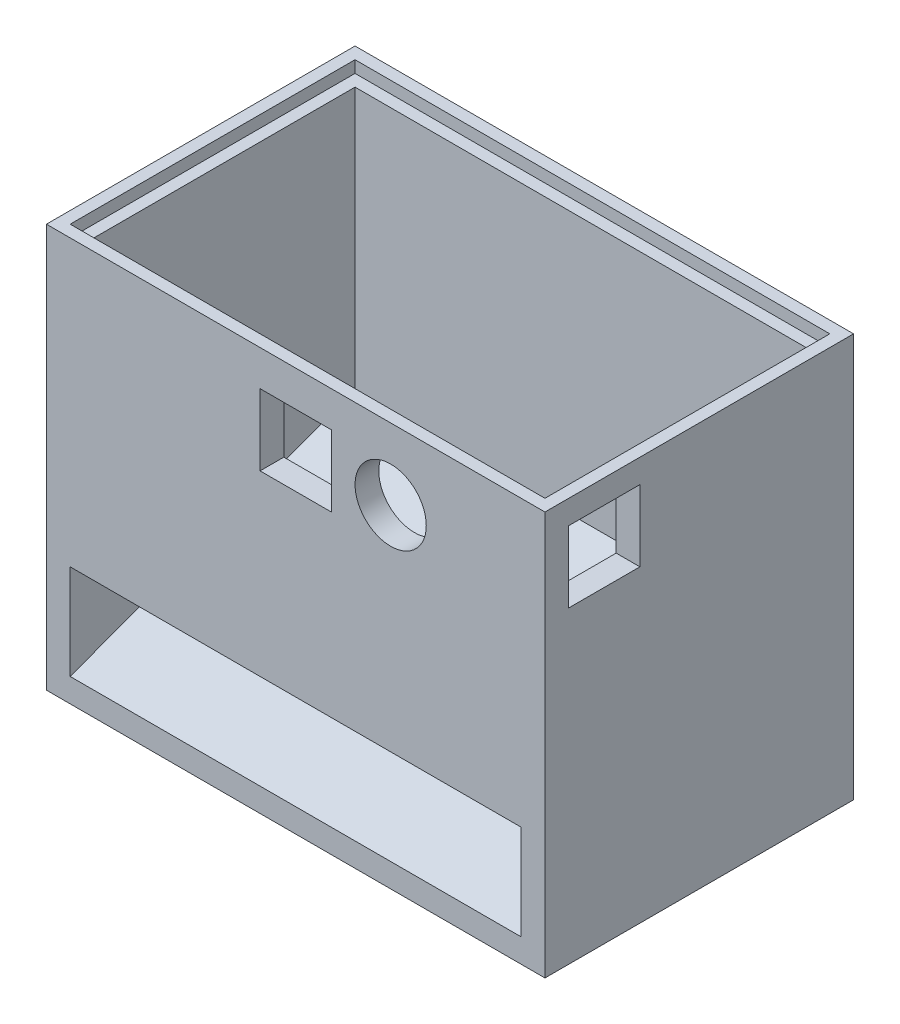
ISO-10303-21;
HEADER;
FILE_DESCRIPTION(('STEP AP214'),'2;1');
FILE_NAME('part.step','',(''),(''),'','','');
FILE_SCHEMA(('AUTOMOTIVE_DESIGN { 1 0 10303 214 1 1 1 1 }'));
ENDSEC;
DATA;
#1=APPLICATION_CONTEXT('core data for automotive mechanical design processes');
#2=APPLICATION_PROTOCOL_DEFINITION('international standard','automotive_design',2000,#1);
#3=PRODUCT_CONTEXT('',#1,'mechanical');
#4=PRODUCT('Part','Part','',(#3));
#5=PRODUCT_RELATED_PRODUCT_CATEGORY('part','',(#4));
#6=PRODUCT_DEFINITION_FORMATION('','',#4);
#7=PRODUCT_DEFINITION_CONTEXT('part definition',#1,'design');
#8=PRODUCT_DEFINITION('design','',#6,#7);
#9=PRODUCT_DEFINITION_SHAPE('','',#8);
#10=(LENGTH_UNIT() NAMED_UNIT(*) SI_UNIT(.MILLI.,.METRE.));
#11=(NAMED_UNIT(*) PLANE_ANGLE_UNIT() SI_UNIT($,.RADIAN.));
#12=(NAMED_UNIT(*) SI_UNIT($,.STERADIAN.) SOLID_ANGLE_UNIT());
#13=UNCERTAINTY_MEASURE_WITH_UNIT(LENGTH_MEASURE(1.E-05),#10,'distance_accuracy_value','');
#14=(GEOMETRIC_REPRESENTATION_CONTEXT(3) GLOBAL_UNCERTAINTY_ASSIGNED_CONTEXT((#13)) GLOBAL_UNIT_ASSIGNED_CONTEXT((#10,
#11,#12)) REPRESENTATION_CONTEXT('',''));
#15=CARTESIAN_POINT('',(0.,0.,0.));
#16=DIRECTION('',(0.,0.,1.));
#17=DIRECTION('',(1.,0.,0.));
#18=AXIS2_PLACEMENT_3D('',#15,#16,#17);
#19=CARTESIAN_POINT('',(-47.5,25.,32.5));
#20=DIRECTION('',(-1.,0.,0.));
#21=DIRECTION('',(0.,0.,1.));
#22=AXIS2_PLACEMENT_3D('',#19,#20,#21);
#23=PLANE('',#22);
#24=DIRECTION('',(0.,-0.347934022521281,0.937519021658847));
#25=VECTOR('',#24,1.);
#26=CARTESIAN_POINT('',(-47.5,5.,32.5));
#27=LINE('',#26,#25);
#28=CARTESIAN_POINT('',(-47.5,27.2673256424587,-27.5));
#29=VERTEX_POINT('',#28);
#30=CARTESIAN_POINT('',(-47.5,5.,32.5));
#31=VERTEX_POINT('',#30);
#32=EDGE_CURVE('E58',#29,#31,#27,.T.);
#33=ORIENTED_EDGE('',*,*,#32,.F.);
#34=DIRECTION('',(0.,-1.,0.));
#35=VECTOR('',#34,1.);
#36=CARTESIAN_POINT('',(-47.5,25.,-27.5));
#37=LINE('',#36,#35);
#38=CARTESIAN_POINT('',(-47.5,82.5,-27.5));
#39=VERTEX_POINT('',#38);
#40=EDGE_CURVE('E273',#39,#29,#37,.T.);
#41=ORIENTED_EDGE('',*,*,#40,.F.);
#42=DIRECTION('',(0.,0.,-1.));
#43=VECTOR('',#42,1.);
#44=CARTESIAN_POINT('',(-47.5,82.5,32.5));
#45=LINE('',#44,#43);
#46=CARTESIAN_POINT('',(-47.5,82.5,27.5));
#47=VERTEX_POINT('',#46);
#48=EDGE_CURVE('E290',#47,#39,#45,.T.);
#49=ORIENTED_EDGE('',*,*,#48,.F.);
#50=DIRECTION('',(0.,-1.,0.));
#51=VECTOR('',#50,1.);
#52=CARTESIAN_POINT('',(-47.5,85.,27.5));
#53=LINE('',#52,#51);
#54=CARTESIAN_POINT('',(-47.5,25.,27.5));
#55=VERTEX_POINT('',#54);
#56=EDGE_CURVE('E270',#47,#55,#53,.T.);
#57=ORIENTED_EDGE('',*,*,#56,.T.);
#58=DIRECTION('',(0.,0.,-1.));
#59=VECTOR('',#58,1.);
#60=CARTESIAN_POINT('',(-47.5,25.,32.5));
#61=LINE('',#60,#59);
#62=CARTESIAN_POINT('',(-47.5,25.,32.5));
#63=VERTEX_POINT('',#62);
#64=EDGE_CURVE('E261',#63,#55,#61,.T.);
#65=ORIENTED_EDGE('',*,*,#64,.F.);
#66=DIRECTION('',(0.,-1.,0.));
#67=VECTOR('',#66,1.);
#68=CARTESIAN_POINT('',(-47.5,25.,32.5));
#69=LINE('',#68,#67);
#70=EDGE_CURVE('E226',#63,#31,#69,.T.);
#71=ORIENTED_EDGE('',*,*,#70,.T.);
#72=EDGE_LOOP('',(#33,#41,#49,#57,#65,#71));
#73=FACE_BOUND('',#72,.T.);
#74=ADVANCED_FACE('F43',(#73),#23,.F.);
#75=CARTESIAN_POINT('',(-47.5,25.,-27.5));
#76=DIRECTION('',(0.,0.,-1.));
#77=DIRECTION('',(-1.,0.,0.));
#78=AXIS2_PLACEMENT_3D('',#75,#76,#77);
#79=PLANE('',#78);
#80=DIRECTION('',(-1.,0.,0.));
#81=VECTOR('',#80,1.);
#82=CARTESIAN_POINT('',(47.5,27.2673256424587,-27.5));
#83=LINE('',#82,#81);
#84=CARTESIAN_POINT('',(47.5,27.2673256424587,-27.5));
#85=VERTEX_POINT('',#84);
#86=EDGE_CURVE('E65',#85,#29,#83,.T.);
#87=ORIENTED_EDGE('',*,*,#86,.F.);
#88=DIRECTION('',(0.,-1.,0.));
#89=VECTOR('',#88,1.);
#90=CARTESIAN_POINT('',(47.5,25.,-27.5));
#91=LINE('',#90,#89);
#92=CARTESIAN_POINT('',(47.5,82.5,-27.5));
#93=VERTEX_POINT('',#92);
#94=EDGE_CURVE('E206',#93,#85,#91,.T.);
#95=ORIENTED_EDGE('',*,*,#94,.F.);
#96=DIRECTION('',(1.,0.,0.));
#97=VECTOR('',#96,1.);
#98=CARTESIAN_POINT('',(-47.5,82.5,-27.5));
#99=LINE('',#98,#97);
#100=EDGE_CURVE('E433',#39,#93,#99,.T.);
#101=ORIENTED_EDGE('',*,*,#100,.F.);
#102=ORIENTED_EDGE('',*,*,#40,.T.);
#103=EDGE_LOOP('',(#87,#95,#101,#102));
#104=FACE_BOUND('',#103,.T.);
#105=ADVANCED_FACE('F309',(#104),#79,.F.);
#106=CARTESIAN_POINT('',(47.5,25.,-27.5));
#107=DIRECTION('',(1.,0.,0.));
#108=DIRECTION('',(0.,0.,-1.));
#109=AXIS2_PLACEMENT_3D('',#106,#107,#108);
#110=PLANE('',#109);
#111=DIRECTION('',(0.,-0.347934022521281,0.937519021658847));
#112=VECTOR('',#111,1.);
#113=CARTESIAN_POINT('',(47.5,5.,32.5));
#114=LINE('',#113,#112);
#115=CARTESIAN_POINT('',(47.5,5.,32.5));
#116=VERTEX_POINT('',#115);
#117=EDGE_CURVE('E210',#85,#116,#114,.T.);
#118=ORIENTED_EDGE('',*,*,#117,.T.);
#119=DIRECTION('',(0.,-1.,0.));
#120=VECTOR('',#119,1.);
#121=CARTESIAN_POINT('',(47.5,25.,32.5));
#122=LINE('',#121,#120);
#123=CARTESIAN_POINT('',(47.5,25.,32.5));
#124=VERTEX_POINT('',#123);
#125=EDGE_CURVE('E194',#124,#116,#122,.T.);
#126=ORIENTED_EDGE('',*,*,#125,.F.);
#127=DIRECTION('',(0.,0.,1.));
#128=VECTOR('',#127,1.);
#129=CARTESIAN_POINT('',(47.5,25.,-27.5));
#130=LINE('',#129,#128);
#131=CARTESIAN_POINT('',(47.5,25.,27.5));
#132=VERTEX_POINT('',#131);
#133=EDGE_CURVE('E207',#132,#124,#130,.T.);
#134=ORIENTED_EDGE('',*,*,#133,.F.);
#135=DIRECTION('',(0.,-1.,0.));
#136=VECTOR('',#135,1.);
#137=CARTESIAN_POINT('',(47.5,85.,27.5));
#138=LINE('',#137,#136);
#139=CARTESIAN_POINT('',(47.5,65.,27.5));
#140=VERTEX_POINT('',#139);
#141=EDGE_CURVE('E282',#140,#132,#138,.T.);
#142=ORIENTED_EDGE('',*,*,#141,.F.);
#143=DIRECTION('',(0.,0.,-1.));
#144=VECTOR('',#143,1.);
#145=CARTESIAN_POINT('',(47.5,65.,-27.5));
#146=LINE('',#145,#144);
#147=CARTESIAN_POINT('',(47.5,65.,12.5));
#148=VERTEX_POINT('',#147);
#149=EDGE_CURVE('E284',#140,#148,#146,.T.);
#150=ORIENTED_EDGE('',*,*,#149,.T.);
#151=DIRECTION('',(0.,1.,0.));
#152=VECTOR('',#151,1.);
#153=CARTESIAN_POINT('',(47.5,25.,12.5));
#154=LINE('',#153,#152);
#155=CARTESIAN_POINT('',(47.5,80.,12.5));
#156=VERTEX_POINT('',#155);
#157=EDGE_CURVE('E356',#148,#156,#154,.T.);
#158=ORIENTED_EDGE('',*,*,#157,.T.);
#159=DIRECTION('',(0.,0.,1.));
#160=VECTOR('',#159,1.);
#161=CARTESIAN_POINT('',(47.5,80.,-27.5));
#162=LINE('',#161,#160);
#163=CARTESIAN_POINT('',(47.5,80.,27.5));
#164=VERTEX_POINT('',#163);
#165=EDGE_CURVE('E358',#156,#164,#162,.T.);
#166=ORIENTED_EDGE('',*,*,#165,.T.);
#167=CARTESIAN_POINT('',(47.5,82.5,27.5));
#168=VERTEX_POINT('',#167);
#169=EDGE_CURVE('E287',#168,#164,#138,.T.);
#170=ORIENTED_EDGE('',*,*,#169,.F.);
#171=DIRECTION('',(0.,0.,1.));
#172=VECTOR('',#171,1.);
#173=CARTESIAN_POINT('',(47.5,82.5,-27.5));
#174=LINE('',#173,#172);
#175=EDGE_CURVE('E425',#93,#168,#174,.T.);
#176=ORIENTED_EDGE('',*,*,#175,.F.);
#177=ORIENTED_EDGE('',*,*,#94,.T.);
#178=EDGE_LOOP('',(#118,#126,#134,#142,#150,#158,#166,#170,#176,#177));
#179=FACE_BOUND('',#178,.T.);
#180=ADVANCED_FACE('F211',(#179),#110,.F.);
#181=CARTESIAN_POINT('',(-47.5,85.,27.5));
#182=DIRECTION('',(0.,0.,-1.));
#183=DIRECTION('',(-1.,0.,0.));
#184=AXIS2_PLACEMENT_3D('',#181,#182,#183);
#185=PLANE('',#184);
#186=ORIENTED_EDGE('',*,*,#169,.T.);
#187=DIRECTION('',(1.,0.,0.));
#188=VECTOR('',#187,1.);
#189=CARTESIAN_POINT('',(42.5,80.,27.5));
#190=LINE('',#189,#188);
#191=CARTESIAN_POINT('',(52.5,80.,27.5));
#192=VERTEX_POINT('',#191);
#193=EDGE_CURVE('E348',#164,#192,#190,.T.);
#194=ORIENTED_EDGE('',*,*,#193,.T.);
#195=DIRECTION('',(0.,-1.,0.));
#196=VECTOR('',#195,1.);
#197=CARTESIAN_POINT('',(52.5,80.,27.5));
#198=LINE('',#197,#196);
#199=CARTESIAN_POINT('',(52.5,65.,27.5));
#200=VERTEX_POINT('',#199);
#201=EDGE_CURVE('E334',#192,#200,#198,.T.);
#202=ORIENTED_EDGE('',*,*,#201,.T.);
#203=DIRECTION('',(1.,0.,0.));
#204=VECTOR('',#203,1.);
#205=CARTESIAN_POINT('',(42.5,65.,27.5));
#206=LINE('',#205,#204);
#207=EDGE_CURVE('E347',#140,#200,#206,.T.);
#208=ORIENTED_EDGE('',*,*,#207,.F.);
#209=ORIENTED_EDGE('',*,*,#141,.T.);
#210=DIRECTION('',(1.,0.,0.));
#211=VECTOR('',#210,1.);
#212=CARTESIAN_POINT('',(-47.5,25.,27.5));
#213=LINE('',#212,#211);
#214=EDGE_CURVE('E279',#55,#132,#213,.T.);
#215=ORIENTED_EDGE('',*,*,#214,.F.);
#216=ORIENTED_EDGE('',*,*,#56,.F.);
#217=DIRECTION('',(1.,0.,0.));
#218=VECTOR('',#217,1.);
#219=CARTESIAN_POINT('',(-47.5,82.5,27.5));
#220=LINE('',#219,#218);
#221=EDGE_CURVE('E11',#47,#168,#220,.T.);
#222=ORIENTED_EDGE('',*,*,#221,.T.);
#223=EDGE_LOOP('',(#186,#194,#202,#208,#209,#215,#216,#222));
#224=FACE_BOUND('',#223,.T.);
#225=CARTESIAN_POINT('',(20.,70.,27.5));
#226=DIRECTION('',(0.,0.,-1.));
#227=DIRECTION('',(-1.,0.,0.));
#228=AXIS2_PLACEMENT_3D('',#225,#226,#227);
#229=CIRCLE('',#228,7.5);
#230=CARTESIAN_POINT('',(12.5,70.,27.5));
#231=VERTEX_POINT('',#230);
#232=EDGE_CURVE('E377',#231,#231,#229,.T.);
#233=ORIENTED_EDGE('',*,*,#232,.F.);
#234=EDGE_LOOP('',(#233));
#235=FACE_BOUND('',#234,.T.);
#236=DIRECTION('',(-1.,0.,0.));
#237=VECTOR('',#236,1.);
#238=CARTESIAN_POINT('',(-47.5,62.5,27.5));
#239=LINE('',#238,#237);
#240=CARTESIAN_POINT('',(7.50000000000001,62.5,27.5));
#241=VERTEX_POINT('',#240);
#242=CARTESIAN_POINT('',(-7.49999999999999,62.5,27.5));
#243=VERTEX_POINT('',#242);
#244=EDGE_CURVE('E394',#241,#243,#239,.T.);
#245=ORIENTED_EDGE('',*,*,#244,.F.);
#246=DIRECTION('',(0.,1.,0.));
#247=VECTOR('',#246,1.);
#248=CARTESIAN_POINT('',(7.50000000000001,85.,27.5));
#249=LINE('',#248,#247);
#250=CARTESIAN_POINT('',(7.5,77.5,27.5));
#251=VERTEX_POINT('',#250);
#252=EDGE_CURVE('E396',#241,#251,#249,.T.);
#253=ORIENTED_EDGE('',*,*,#252,.T.);
#254=DIRECTION('',(-1.,0.,0.));
#255=VECTOR('',#254,1.);
#256=CARTESIAN_POINT('',(-47.5,77.5,27.5));
#257=LINE('',#256,#255);
#258=CARTESIAN_POINT('',(-7.49999999999999,77.5,27.5));
#259=VERTEX_POINT('',#258);
#260=EDGE_CURVE('E388',#251,#259,#257,.T.);
#261=ORIENTED_EDGE('',*,*,#260,.T.);
#262=DIRECTION('',(0.,1.,0.));
#263=VECTOR('',#262,1.);
#264=CARTESIAN_POINT('',(-7.49999999999999,85.,27.5));
#265=LINE('',#264,#263);
#266=EDGE_CURVE('E391',#243,#259,#265,.T.);
#267=ORIENTED_EDGE('',*,*,#266,.F.);
#268=EDGE_LOOP('',(#245,#253,#261,#267));
#269=FACE_BOUND('',#268,.T.);
#270=ADVANCED_FACE('F319',(#224,#235,#269),#185,.T.);
#271=CARTESIAN_POINT('',(-52.5,5.,32.5));
#272=DIRECTION('',(0.,0.,-1.));
#273=DIRECTION('',(-1.,0.,0.));
#274=AXIS2_PLACEMENT_3D('',#271,#272,#273);
#275=PLANE('',#274);
#276=DIRECTION('',(1.,0.,0.));
#277=VECTOR('',#276,1.);
#278=CARTESIAN_POINT('',(-52.5,0.,32.5));
#279=LINE('',#278,#277);
#280=CARTESIAN_POINT('',(-52.5,0.,32.5));
#281=VERTEX_POINT('',#280);
#282=CARTESIAN_POINT('',(52.5,0.,32.5));
#283=VERTEX_POINT('',#282);
#284=EDGE_CURVE('E217',#281,#283,#279,.T.);
#285=ORIENTED_EDGE('',*,*,#284,.T.);
#286=DIRECTION('',(0.,-1.,0.));
#287=VECTOR('',#286,1.);
#288=CARTESIAN_POINT('',(52.5,5.,32.5));
#289=LINE('',#288,#287);
#290=CARTESIAN_POINT('',(52.5,85.,32.5));
#291=VERTEX_POINT('',#290);
#292=EDGE_CURVE('E216',#291,#283,#289,.T.);
#293=ORIENTED_EDGE('',*,*,#292,.F.);
#294=DIRECTION('',(1.,0.,0.));
#295=VECTOR('',#294,1.);
#296=CARTESIAN_POINT('',(-52.5,85.,32.5));
#297=LINE('',#296,#295);
#298=CARTESIAN_POINT('',(-52.5,85.,32.5));
#299=VERTEX_POINT('',#298);
#300=EDGE_CURVE('E259',#299,#291,#297,.T.);
#301=ORIENTED_EDGE('',*,*,#300,.F.);
#302=DIRECTION('',(0.,-1.,0.));
#303=VECTOR('',#302,1.);
#304=CARTESIAN_POINT('',(-52.5,5.,32.5));
#305=LINE('',#304,#303);
#306=EDGE_CURVE('E220',#299,#281,#305,.T.);
#307=ORIENTED_EDGE('',*,*,#306,.T.);
#308=EDGE_LOOP('',(#285,#293,#301,#307));
#309=FACE_BOUND('',#308,.T.);
#310=ORIENTED_EDGE('',*,*,#70,.F.);
#311=DIRECTION('',(1.,0.,0.));
#312=VECTOR('',#311,1.);
#313=CARTESIAN_POINT('',(-52.5,25.,32.5));
#314=LINE('',#313,#312);
#315=EDGE_CURVE('E202',#63,#124,#314,.T.);
#316=ORIENTED_EDGE('',*,*,#315,.T.);
#317=ORIENTED_EDGE('',*,*,#125,.T.);
#318=DIRECTION('',(1.,0.,0.));
#319=VECTOR('',#318,1.);
#320=CARTESIAN_POINT('',(-52.5,5.,32.5));
#321=LINE('',#320,#319);
#322=EDGE_CURVE('E200',#31,#116,#321,.T.);
#323=ORIENTED_EDGE('',*,*,#322,.F.);
#324=EDGE_LOOP('',(#310,#316,#317,#323));
#325=FACE_BOUND('',#324,.T.);
#326=CARTESIAN_POINT('',(20.,70.,32.5));
#327=DIRECTION('',(0.,0.,1.));
#328=DIRECTION('',(1.,0.,0.));
#329=AXIS2_PLACEMENT_3D('',#326,#327,#328);
#330=CIRCLE('',#329,7.5);
#331=CARTESIAN_POINT('',(27.5,70.,32.5));
#332=VERTEX_POINT('',#331);
#333=EDGE_CURVE('E361',#332,#332,#330,.T.);
#334=ORIENTED_EDGE('',*,*,#333,.F.);
#335=EDGE_LOOP('',(#334));
#336=FACE_BOUND('',#335,.T.);
#337=DIRECTION('',(0.,-1.,0.));
#338=VECTOR('',#337,1.);
#339=CARTESIAN_POINT('',(7.50000000000001,0.,32.5));
#340=LINE('',#339,#338);
#341=CARTESIAN_POINT('',(7.5,77.5,32.5));
#342=VERTEX_POINT('',#341);
#343=CARTESIAN_POINT('',(7.50000000000001,62.5,32.5));
#344=VERTEX_POINT('',#343);
#345=EDGE_CURVE('E362',#342,#344,#340,.T.);
#346=ORIENTED_EDGE('',*,*,#345,.T.);
#347=DIRECTION('',(1.,0.,0.));
#348=VECTOR('',#347,1.);
#349=CARTESIAN_POINT('',(0.,62.5,32.5));
#350=LINE('',#349,#348);
#351=CARTESIAN_POINT('',(-7.49999999999999,62.5,32.5));
#352=VERTEX_POINT('',#351);
#353=EDGE_CURVE('E371',#352,#344,#350,.T.);
#354=ORIENTED_EDGE('',*,*,#353,.F.);
#355=DIRECTION('',(0.,-1.,0.));
#356=VECTOR('',#355,1.);
#357=CARTESIAN_POINT('',(-7.49999999999999,0.,32.5));
#358=LINE('',#357,#356);
#359=CARTESIAN_POINT('',(-7.5,77.5,32.5));
#360=VERTEX_POINT('',#359);
#361=EDGE_CURVE('E368',#360,#352,#358,.T.);
#362=ORIENTED_EDGE('',*,*,#361,.F.);
#363=DIRECTION('',(1.,0.,0.));
#364=VECTOR('',#363,1.);
#365=CARTESIAN_POINT('',(0.,77.5,32.5));
#366=LINE('',#365,#364);
#367=EDGE_CURVE('E365',#360,#342,#366,.T.);
#368=ORIENTED_EDGE('',*,*,#367,.T.);
#369=EDGE_LOOP('',(#346,#354,#362,#368));
#370=FACE_BOUND('',#369,.T.);
#371=ADVANCED_FACE('F197',(#309,#325,#336,#370),#275,.F.);
#372=CARTESIAN_POINT('',(52.5,5.,32.5));
#373=DIRECTION('',(-1.,0.,0.));
#374=DIRECTION('',(0.,0.,1.));
#375=AXIS2_PLACEMENT_3D('',#372,#373,#374);
#376=PLANE('',#375);
#377=DIRECTION('',(0.,0.,-1.));
#378=VECTOR('',#377,1.);
#379=CARTESIAN_POINT('',(52.5,65.,27.5));
#380=LINE('',#379,#378);
#381=CARTESIAN_POINT('',(52.5,65.,12.5));
#382=VERTEX_POINT('',#381);
#383=EDGE_CURVE('E332',#200,#382,#380,.T.);
#384=ORIENTED_EDGE('',*,*,#383,.F.);
#385=ORIENTED_EDGE('',*,*,#201,.F.);
#386=DIRECTION('',(0.,0.,1.));
#387=VECTOR('',#386,1.);
#388=CARTESIAN_POINT('',(52.5,80.,27.5));
#389=LINE('',#388,#387);
#390=CARTESIAN_POINT('',(52.5,80.,12.5));
#391=VERTEX_POINT('',#390);
#392=EDGE_CURVE('E340',#391,#192,#389,.T.);
#393=ORIENTED_EDGE('',*,*,#392,.F.);
#394=DIRECTION('',(0.,1.,0.));
#395=VECTOR('',#394,1.);
#396=CARTESIAN_POINT('',(52.5,80.,12.5));
#397=LINE('',#396,#395);
#398=EDGE_CURVE('E336',#382,#391,#397,.T.);
#399=ORIENTED_EDGE('',*,*,#398,.F.);
#400=EDGE_LOOP('',(#384,#385,#393,#399));
#401=FACE_BOUND('',#400,.T.);
#402=DIRECTION('',(0.,0.,-1.));
#403=VECTOR('',#402,1.);
#404=CARTESIAN_POINT('',(52.5,0.,32.5));
#405=LINE('',#404,#403);
#406=CARTESIAN_POINT('',(52.5,0.,-32.5));
#407=VERTEX_POINT('',#406);
#408=EDGE_CURVE('E228',#283,#407,#405,.T.);
#409=ORIENTED_EDGE('',*,*,#408,.T.);
#410=DIRECTION('',(0.,-1.,0.));
#411=VECTOR('',#410,1.);
#412=CARTESIAN_POINT('',(52.5,5.,-32.5));
#413=LINE('',#412,#411);
#414=CARTESIAN_POINT('',(52.5,85.,-32.5));
#415=VERTEX_POINT('',#414);
#416=EDGE_CURVE('E51',#415,#407,#413,.T.);
#417=ORIENTED_EDGE('',*,*,#416,.F.);
#418=DIRECTION('',(0.,0.,-1.));
#419=VECTOR('',#418,1.);
#420=CARTESIAN_POINT('',(52.5,85.,32.5));
#421=LINE('',#420,#419);
#422=EDGE_CURVE('E269',#291,#415,#421,.T.);
#423=ORIENTED_EDGE('',*,*,#422,.F.);
#424=ORIENTED_EDGE('',*,*,#292,.T.);
#425=EDGE_LOOP('',(#409,#417,#423,#424));
#426=FACE_BOUND('',#425,.T.);
#427=ADVANCED_FACE('F45',(#401,#426),#376,.F.);
#428=CARTESIAN_POINT('',(-52.5,5.,-32.5));
#429=DIRECTION('',(0.,0.,1.));
#430=DIRECTION('',(1.,0.,0.));
#431=AXIS2_PLACEMENT_3D('',#428,#429,#430);
#432=PLANE('',#431);
#433=DIRECTION('',(-1.,0.,0.));
#434=VECTOR('',#433,1.);
#435=CARTESIAN_POINT('',(-52.5,0.,-32.5));
#436=LINE('',#435,#434);
#437=CARTESIAN_POINT('',(-52.5,0.,-32.5));
#438=VERTEX_POINT('',#437);
#439=EDGE_CURVE('E231',#407,#438,#436,.T.);
#440=ORIENTED_EDGE('',*,*,#439,.T.);
#441=DIRECTION('',(0.,-1.,0.));
#442=VECTOR('',#441,1.);
#443=CARTESIAN_POINT('',(-52.5,5.,-32.5));
#444=LINE('',#443,#442);
#445=CARTESIAN_POINT('',(-52.5,85.,-32.5));
#446=VERTEX_POINT('',#445);
#447=EDGE_CURVE('E236',#446,#438,#444,.T.);
#448=ORIENTED_EDGE('',*,*,#447,.F.);
#449=DIRECTION('',(-1.,0.,0.));
#450=VECTOR('',#449,1.);
#451=CARTESIAN_POINT('',(-52.5,85.,-32.5));
#452=LINE('',#451,#450);
#453=EDGE_CURVE('E243',#415,#446,#452,.T.);
#454=ORIENTED_EDGE('',*,*,#453,.F.);
#455=ORIENTED_EDGE('',*,*,#416,.T.);
#456=EDGE_LOOP('',(#440,#448,#454,#455));
#457=FACE_BOUND('',#456,.T.);
#458=ADVANCED_FACE('F241',(#457),#432,.F.);
#459=CARTESIAN_POINT('',(-52.5,5.,32.5));
#460=DIRECTION('',(1.,0.,0.));
#461=DIRECTION('',(0.,0.,-1.));
#462=AXIS2_PLACEMENT_3D('',#459,#460,#461);
#463=PLANE('',#462);
#464=DIRECTION('',(0.,0.,1.));
#465=VECTOR('',#464,1.);
#466=CARTESIAN_POINT('',(-52.5,0.,32.5));
#467=LINE('',#466,#465);
#468=EDGE_CURVE('E222',#438,#281,#467,.T.);
#469=ORIENTED_EDGE('',*,*,#468,.T.);
#470=ORIENTED_EDGE('',*,*,#306,.F.);
#471=DIRECTION('',(0.,0.,1.));
#472=VECTOR('',#471,1.);
#473=CARTESIAN_POINT('',(-52.5,85.,32.5));
#474=LINE('',#473,#472);
#475=EDGE_CURVE('E262',#446,#299,#474,.T.);
#476=ORIENTED_EDGE('',*,*,#475,.F.);
#477=ORIENTED_EDGE('',*,*,#447,.T.);
#478=EDGE_LOOP('',(#469,#470,#476,#477));
#479=FACE_BOUND('',#478,.T.);
#480=ADVANCED_FACE('F253',(#479),#463,.F.);
#481=CARTESIAN_POINT('',(0.,0.,0.));
#482=DIRECTION('',(0.,-1.,0.));
#483=DIRECTION('',(0.,0.,-1.));
#484=AXIS2_PLACEMENT_3D('',#481,#482,#483);
#485=PLANE('',#484);
#486=ORIENTED_EDGE('',*,*,#408,.F.);
#487=ORIENTED_EDGE('',*,*,#284,.F.);
#488=ORIENTED_EDGE('',*,*,#468,.F.);
#489=ORIENTED_EDGE('',*,*,#439,.F.);
#490=EDGE_LOOP('',(#486,#487,#488,#489));
#491=FACE_BOUND('',#490,.T.);
#492=ADVANCED_FACE('F250',(#491),#485,.T.);
#493=CARTESIAN_POINT('',(0.,85.,0.));
#494=DIRECTION('',(0.,-1.,0.));
#495=DIRECTION('',(0.,0.,-1.));
#496=AXIS2_PLACEMENT_3D('',#493,#494,#495);
#497=PLANE('',#496);
#498=DIRECTION('',(1.,0.,0.));
#499=VECTOR('',#498,1.);
#500=CARTESIAN_POINT('',(50.,85.,30.));
#501=LINE('',#500,#499);
#502=CARTESIAN_POINT('',(-50.,85.,30.));
#503=VERTEX_POINT('',#502);
#504=CARTESIAN_POINT('',(50.,85.,30.));
#505=VERTEX_POINT('',#504);
#506=EDGE_CURVE('E415',#503,#505,#501,.T.);
#507=ORIENTED_EDGE('',*,*,#506,.F.);
#508=DIRECTION('',(0.,0.,1.));
#509=VECTOR('',#508,1.);
#510=CARTESIAN_POINT('',(-50.,85.,30.));
#511=LINE('',#510,#509);
#512=CARTESIAN_POINT('',(-50.,85.,-30.));
#513=VERTEX_POINT('',#512);
#514=EDGE_CURVE('E399',#513,#503,#511,.T.);
#515=ORIENTED_EDGE('',*,*,#514,.F.);
#516=DIRECTION('',(-1.,0.,0.));
#517=VECTOR('',#516,1.);
#518=CARTESIAN_POINT('',(50.,85.,-30.));
#519=LINE('',#518,#517);
#520=CARTESIAN_POINT('',(50.,85.,-30.));
#521=VERTEX_POINT('',#520);
#522=EDGE_CURVE('E404',#521,#513,#519,.T.);
#523=ORIENTED_EDGE('',*,*,#522,.F.);
#524=DIRECTION('',(0.,0.,-1.));
#525=VECTOR('',#524,1.);
#526=CARTESIAN_POINT('',(50.,85.,30.));
#527=LINE('',#526,#525);
#528=EDGE_CURVE('E418',#505,#521,#527,.T.);
#529=ORIENTED_EDGE('',*,*,#528,.F.);
#530=EDGE_LOOP('',(#507,#515,#523,#529));
#531=FACE_BOUND('',#530,.T.);
#532=ORIENTED_EDGE('',*,*,#422,.T.);
#533=ORIENTED_EDGE('',*,*,#453,.T.);
#534=ORIENTED_EDGE('',*,*,#475,.T.);
#535=ORIENTED_EDGE('',*,*,#300,.T.);
#536=EDGE_LOOP('',(#532,#533,#534,#535));
#537=FACE_BOUND('',#536,.T.);
#538=ADVANCED_FACE('F295',(#531,#537),#497,.F.);
#539=CARTESIAN_POINT('',(0.,25.,0.));
#540=DIRECTION('',(0.,-1.,0.));
#541=DIRECTION('',(0.,0.,-1.));
#542=AXIS2_PLACEMENT_3D('',#539,#540,#541);
#543=PLANE('',#542);
#544=ORIENTED_EDGE('',*,*,#315,.F.);
#545=ORIENTED_EDGE('',*,*,#64,.T.);
#546=ORIENTED_EDGE('',*,*,#214,.T.);
#547=ORIENTED_EDGE('',*,*,#133,.T.);
#548=EDGE_LOOP('',(#544,#545,#546,#547));
#549=FACE_BOUND('',#548,.T.);
#550=ADVANCED_FACE('F276',(#549),#543,.T.);
#551=CARTESIAN_POINT('',(0.,82.5,0.));
#552=DIRECTION('',(0.,1.,0.));
#553=DIRECTION('',(0.,0.,1.));
#554=AXIS2_PLACEMENT_3D('',#551,#552,#553);
#555=PLANE('',#554);
#556=DIRECTION('',(0.,0.,1.));
#557=VECTOR('',#556,1.);
#558=CARTESIAN_POINT('',(-50.,82.5,30.));
#559=LINE('',#558,#557);
#560=CARTESIAN_POINT('',(-50.,82.5,-30.));
#561=VERTEX_POINT('',#560);
#562=CARTESIAN_POINT('',(-50.,82.5,30.));
#563=VERTEX_POINT('',#562);
#564=EDGE_CURVE('E400',#561,#563,#559,.T.);
#565=ORIENTED_EDGE('',*,*,#564,.T.);
#566=DIRECTION('',(1.,0.,0.));
#567=VECTOR('',#566,1.);
#568=CARTESIAN_POINT('',(50.,82.5,30.));
#569=LINE('',#568,#567);
#570=CARTESIAN_POINT('',(50.,82.5,30.));
#571=VERTEX_POINT('',#570);
#572=EDGE_CURVE('E403',#563,#571,#569,.T.);
#573=ORIENTED_EDGE('',*,*,#572,.T.);
#574=DIRECTION('',(0.,0.,-1.));
#575=VECTOR('',#574,1.);
#576=CARTESIAN_POINT('',(50.,82.5,30.));
#577=LINE('',#576,#575);
#578=CARTESIAN_POINT('',(50.,82.5,-30.));
#579=VERTEX_POINT('',#578);
#580=EDGE_CURVE('E407',#571,#579,#577,.T.);
#581=ORIENTED_EDGE('',*,*,#580,.T.);
#582=DIRECTION('',(-1.,0.,0.));
#583=VECTOR('',#582,1.);
#584=CARTESIAN_POINT('',(50.,82.5,-30.));
#585=LINE('',#584,#583);
#586=EDGE_CURVE('E410',#579,#561,#585,.T.);
#587=ORIENTED_EDGE('',*,*,#586,.T.);
#588=EDGE_LOOP('',(#565,#573,#581,#587));
#589=FACE_BOUND('',#588,.T.);
#590=ORIENTED_EDGE('',*,*,#48,.T.);
#591=ORIENTED_EDGE('',*,*,#100,.T.);
#592=ORIENTED_EDGE('',*,*,#175,.T.);
#593=ORIENTED_EDGE('',*,*,#221,.F.);
#594=EDGE_LOOP('',(#590,#591,#592,#593));
#595=FACE_BOUND('',#594,.T.);
#596=ADVANCED_FACE('F303',(#589,#595),#555,.T.);
#597=CARTESIAN_POINT('',(-50.,82.5,30.));
#598=DIRECTION('',(-1.,0.,0.));
#599=DIRECTION('',(0.,0.,1.));
#600=AXIS2_PLACEMENT_3D('',#597,#598,#599);
#601=PLANE('',#600);
#602=ORIENTED_EDGE('',*,*,#514,.T.);
#603=DIRECTION('',(0.,1.,0.));
#604=VECTOR('',#603,1.);
#605=CARTESIAN_POINT('',(-50.,82.5,30.));
#606=LINE('',#605,#604);
#607=EDGE_CURVE('E413',#563,#503,#606,.T.);
#608=ORIENTED_EDGE('',*,*,#607,.F.);
#609=ORIENTED_EDGE('',*,*,#564,.F.);
#610=DIRECTION('',(0.,1.,0.));
#611=VECTOR('',#610,1.);
#612=CARTESIAN_POINT('',(-50.,82.5,-30.));
#613=LINE('',#612,#611);
#614=EDGE_CURVE('E423',#561,#513,#613,.T.);
#615=ORIENTED_EDGE('',*,*,#614,.T.);
#616=EDGE_LOOP('',(#602,#608,#609,#615));
#617=FACE_BOUND('',#616,.T.);
#618=ADVANCED_FACE('F479',(#617),#601,.F.);
#619=CARTESIAN_POINT('',(50.,82.5,-30.));
#620=DIRECTION('',(0.,0.,-1.));
#621=DIRECTION('',(-1.,0.,0.));
#622=AXIS2_PLACEMENT_3D('',#619,#620,#621);
#623=PLANE('',#622);
#624=ORIENTED_EDGE('',*,*,#522,.T.);
#625=ORIENTED_EDGE('',*,*,#614,.F.);
#626=ORIENTED_EDGE('',*,*,#586,.F.);
#627=DIRECTION('',(0.,1.,0.));
#628=VECTOR('',#627,1.);
#629=CARTESIAN_POINT('',(50.,82.5,-30.));
#630=LINE('',#629,#628);
#631=EDGE_CURVE('E426',#579,#521,#630,.T.);
#632=ORIENTED_EDGE('',*,*,#631,.T.);
#633=EDGE_LOOP('',(#624,#625,#626,#632));
#634=FACE_BOUND('',#633,.T.);
#635=ADVANCED_FACE('F481',(#634),#623,.F.);
#636=CARTESIAN_POINT('',(50.,82.5,30.));
#637=DIRECTION('',(1.,0.,0.));
#638=DIRECTION('',(0.,0.,-1.));
#639=AXIS2_PLACEMENT_3D('',#636,#637,#638);
#640=PLANE('',#639);
#641=ORIENTED_EDGE('',*,*,#528,.T.);
#642=ORIENTED_EDGE('',*,*,#631,.F.);
#643=ORIENTED_EDGE('',*,*,#580,.F.);
#644=DIRECTION('',(0.,1.,0.));
#645=VECTOR('',#644,1.);
#646=CARTESIAN_POINT('',(50.,82.5,30.));
#647=LINE('',#646,#645);
#648=EDGE_CURVE('E428',#571,#505,#647,.T.);
#649=ORIENTED_EDGE('',*,*,#648,.T.);
#650=EDGE_LOOP('',(#641,#642,#643,#649));
#651=FACE_BOUND('',#650,.T.);
#652=ADVANCED_FACE('F484',(#651),#640,.F.);
#653=CARTESIAN_POINT('',(50.,82.5,30.));
#654=DIRECTION('',(0.,0.,1.));
#655=DIRECTION('',(1.,0.,0.));
#656=AXIS2_PLACEMENT_3D('',#653,#654,#655);
#657=PLANE('',#656);
#658=ORIENTED_EDGE('',*,*,#506,.T.);
#659=ORIENTED_EDGE('',*,*,#648,.F.);
#660=ORIENTED_EDGE('',*,*,#572,.F.);
#661=ORIENTED_EDGE('',*,*,#607,.T.);
#662=EDGE_LOOP('',(#658,#659,#660,#661));
#663=FACE_BOUND('',#662,.T.);
#664=ADVANCED_FACE('F475',(#663),#657,.F.);
#665=CARTESIAN_POINT('',(20.,70.,22.5));
#666=DIRECTION('',(0.,0.,1.));
#667=DIRECTION('',(1.,0.,0.));
#668=AXIS2_PLACEMENT_3D('',#665,#666,#667);
#669=CYLINDRICAL_SURFACE('',#668,7.5);
#670=ORIENTED_EDGE('',*,*,#232,.T.);
#671=EDGE_LOOP('',(#670));
#672=FACE_BOUND('',#671,.T.);
#673=ORIENTED_EDGE('',*,*,#333,.T.);
#674=EDGE_LOOP('',(#673));
#675=FACE_BOUND('',#674,.T.);
#676=ADVANCED_FACE('F471',(#672,#675),#669,.F.);
#677=CARTESIAN_POINT('',(7.50000000000001,0.,22.5));
#678=DIRECTION('',(-1.,0.,0.));
#679=DIRECTION('',(0.,-1.,0.));
#680=AXIS2_PLACEMENT_3D('',#677,#678,#679);
#681=PLANE('',#680);
#682=DIRECTION('',(0.,0.,1.));
#683=VECTOR('',#682,1.);
#684=CARTESIAN_POINT('',(7.50000000000001,62.5,22.5));
#685=LINE('',#684,#683);
#686=EDGE_CURVE('E375',#241,#344,#685,.T.);
#687=ORIENTED_EDGE('',*,*,#686,.T.);
#688=ORIENTED_EDGE('',*,*,#345,.F.);
#689=DIRECTION('',(0.,0.,1.));
#690=VECTOR('',#689,1.);
#691=CARTESIAN_POINT('',(7.5,77.5,22.5));
#692=LINE('',#691,#690);
#693=EDGE_CURVE('E374',#251,#342,#692,.T.);
#694=ORIENTED_EDGE('',*,*,#693,.F.);
#695=ORIENTED_EDGE('',*,*,#252,.F.);
#696=EDGE_LOOP('',(#687,#688,#694,#695));
#697=FACE_BOUND('',#696,.T.);
#698=ADVANCED_FACE('F460',(#697),#681,.T.);
#699=CARTESIAN_POINT('',(0.,62.5,22.5));
#700=DIRECTION('',(0.,-1.,0.));
#701=DIRECTION('',(0.,0.,-1.));
#702=AXIS2_PLACEMENT_3D('',#699,#700,#701);
#703=PLANE('',#702);
#704=ORIENTED_EDGE('',*,*,#244,.T.);
#705=DIRECTION('',(0.,0.,1.));
#706=VECTOR('',#705,1.);
#707=CARTESIAN_POINT('',(-7.49999999999999,62.5,22.5));
#708=LINE('',#707,#706);
#709=EDGE_CURVE('E378',#243,#352,#708,.T.);
#710=ORIENTED_EDGE('',*,*,#709,.T.);
#711=ORIENTED_EDGE('',*,*,#353,.T.);
#712=ORIENTED_EDGE('',*,*,#686,.F.);
#713=EDGE_LOOP('',(#704,#710,#711,#712));
#714=FACE_BOUND('',#713,.T.);
#715=ADVANCED_FACE('F456',(#714),#703,.F.);
#716=CARTESIAN_POINT('',(-7.49999999999999,0.,22.5));
#717=DIRECTION('',(-1.,0.,0.));
#718=DIRECTION('',(0.,-1.,0.));
#719=AXIS2_PLACEMENT_3D('',#716,#717,#718);
#720=PLANE('',#719);
#721=ORIENTED_EDGE('',*,*,#266,.T.);
#722=DIRECTION('',(0.,0.,1.));
#723=VECTOR('',#722,1.);
#724=CARTESIAN_POINT('',(-7.5,77.5,22.5));
#725=LINE('',#724,#723);
#726=EDGE_CURVE('E380',#259,#360,#725,.T.);
#727=ORIENTED_EDGE('',*,*,#726,.T.);
#728=ORIENTED_EDGE('',*,*,#361,.T.);
#729=ORIENTED_EDGE('',*,*,#709,.F.);
#730=EDGE_LOOP('',(#721,#727,#728,#729));
#731=FACE_BOUND('',#730,.T.);
#732=ADVANCED_FACE('F459',(#731),#720,.F.);
#733=CARTESIAN_POINT('',(0.,77.5,22.5));
#734=DIRECTION('',(0.,-1.,0.));
#735=DIRECTION('',(0.,0.,-1.));
#736=AXIS2_PLACEMENT_3D('',#733,#734,#735);
#737=PLANE('',#736);
#738=ORIENTED_EDGE('',*,*,#693,.T.);
#739=ORIENTED_EDGE('',*,*,#367,.F.);
#740=ORIENTED_EDGE('',*,*,#726,.F.);
#741=ORIENTED_EDGE('',*,*,#260,.F.);
#742=EDGE_LOOP('',(#738,#739,#740,#741));
#743=FACE_BOUND('',#742,.T.);
#744=ADVANCED_FACE('F464',(#743),#737,.T.);
#745=CARTESIAN_POINT('',(42.5,80.,27.5));
#746=DIRECTION('',(0.,1.,0.));
#747=DIRECTION('',(0.,0.,1.));
#748=AXIS2_PLACEMENT_3D('',#745,#746,#747);
#749=PLANE('',#748);
#750=DIRECTION('',(1.,0.,0.));
#751=VECTOR('',#750,1.);
#752=CARTESIAN_POINT('',(42.5,80.,12.5));
#753=LINE('',#752,#751);
#754=EDGE_CURVE('E350',#156,#391,#753,.T.);
#755=ORIENTED_EDGE('',*,*,#754,.T.);
#756=ORIENTED_EDGE('',*,*,#392,.T.);
#757=ORIENTED_EDGE('',*,*,#193,.F.);
#758=ORIENTED_EDGE('',*,*,#165,.F.);
#759=EDGE_LOOP('',(#755,#756,#757,#758));
#760=FACE_BOUND('',#759,.T.);
#761=ADVANCED_FACE('F442',(#760),#749,.F.);
#762=CARTESIAN_POINT('',(42.5,80.,12.5));
#763=DIRECTION('',(0.,0.,-1.));
#764=DIRECTION('',(0.,1.,0.));
#765=AXIS2_PLACEMENT_3D('',#762,#763,#764);
#766=PLANE('',#765);
#767=DIRECTION('',(1.,0.,0.));
#768=VECTOR('',#767,1.);
#769=CARTESIAN_POINT('',(42.5,65.,12.5));
#770=LINE('',#769,#768);
#771=EDGE_CURVE('E352',#148,#382,#770,.T.);
#772=ORIENTED_EDGE('',*,*,#771,.T.);
#773=ORIENTED_EDGE('',*,*,#398,.T.);
#774=ORIENTED_EDGE('',*,*,#754,.F.);
#775=ORIENTED_EDGE('',*,*,#157,.F.);
#776=EDGE_LOOP('',(#772,#773,#774,#775));
#777=FACE_BOUND('',#776,.T.);
#778=ADVANCED_FACE('F444',(#777),#766,.F.);
#779=CARTESIAN_POINT('',(42.5,65.,27.5));
#780=DIRECTION('',(0.,-1.,0.));
#781=DIRECTION('',(0.,0.,-1.));
#782=AXIS2_PLACEMENT_3D('',#779,#780,#781);
#783=PLANE('',#782);
#784=ORIENTED_EDGE('',*,*,#207,.T.);
#785=ORIENTED_EDGE('',*,*,#383,.T.);
#786=ORIENTED_EDGE('',*,*,#771,.F.);
#787=ORIENTED_EDGE('',*,*,#149,.F.);
#788=EDGE_LOOP('',(#784,#785,#786,#787));
#789=FACE_BOUND('',#788,.T.);
#790=ADVANCED_FACE('F445',(#789),#783,.F.);
#791=CARTESIAN_POINT('',(47.5,5.,32.5));
#792=DIRECTION('',(0.,-0.937519021658847,-0.347934022521281));
#793=DIRECTION('',(0.,0.347934022521281,-0.937519021658847));
#794=AXIS2_PLACEMENT_3D('',#791,#792,#793);
#795=PLANE('',#794);
#796=ORIENTED_EDGE('',*,*,#32,.T.);
#797=ORIENTED_EDGE('',*,*,#322,.T.);
#798=ORIENTED_EDGE('',*,*,#117,.F.);
#799=ORIENTED_EDGE('',*,*,#86,.T.);
#800=EDGE_LOOP('',(#796,#797,#798,#799));
#801=FACE_BOUND('',#800,.T.);
#802=ADVANCED_FACE('F215',(#801),#795,.F.);
#803=CLOSED_SHELL('',(#74,#105,#180,#270,#371,#427,#458,#480,#492,#538,#550,#596,#618,#635,#652,
#664,#676,#698,#715,#732,#744,#761,#778,#790,#802));
#804=MANIFOLD_SOLID_BREP('B2',#803);
#805=ADVANCED_BREP_SHAPE_REPRESENTATION('',(#18,#804),#14);
#806=SHAPE_DEFINITION_REPRESENTATION(#9,#805);
ENDSEC;
END-ISO-10303-21;
